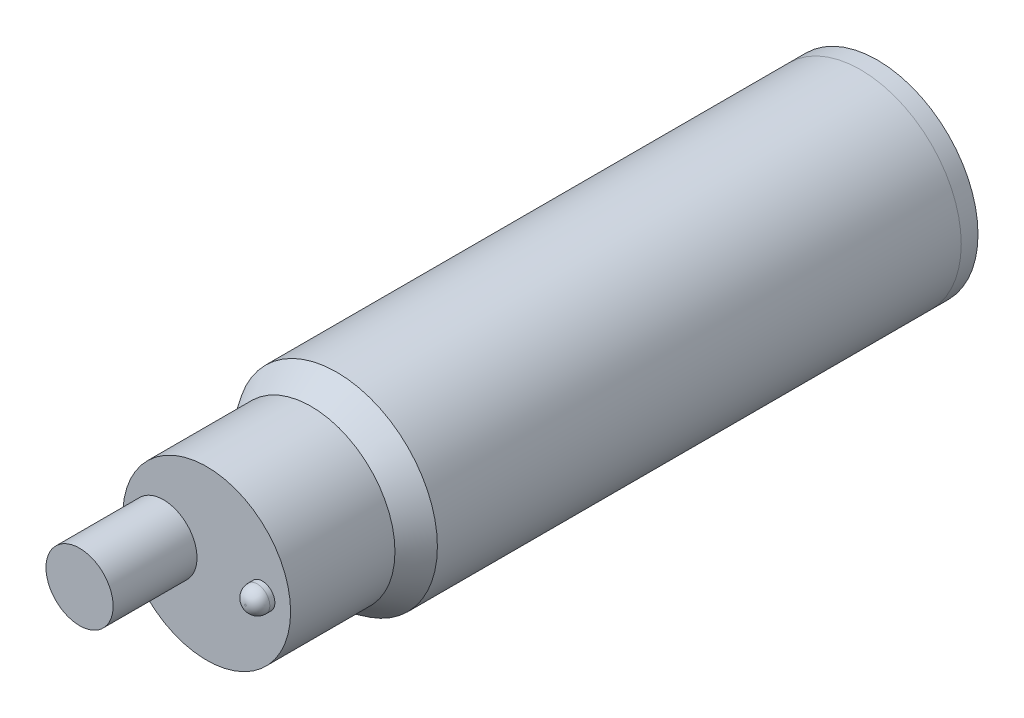
ISO-10303-21;
HEADER;
FILE_DESCRIPTION(('STEP AP214'),'2;1');
FILE_NAME('part.step','',(''),(''),'','','');
FILE_SCHEMA(('AUTOMOTIVE_DESIGN { 1 0 10303 214 1 1 1 1 }'));
ENDSEC;
DATA;
#1=APPLICATION_CONTEXT('core data for automotive mechanical design processes');
#2=APPLICATION_PROTOCOL_DEFINITION('international standard','automotive_design',2000,#1);
#3=PRODUCT_CONTEXT('',#1,'mechanical');
#4=PRODUCT('Part','Part','',(#3));
#5=PRODUCT_RELATED_PRODUCT_CATEGORY('part','',(#4));
#6=PRODUCT_DEFINITION_FORMATION('','',#4);
#7=PRODUCT_DEFINITION_CONTEXT('part definition',#1,'design');
#8=PRODUCT_DEFINITION('design','',#6,#7);
#9=PRODUCT_DEFINITION_SHAPE('','',#8);
#10=(LENGTH_UNIT() NAMED_UNIT(*) SI_UNIT(.MILLI.,.METRE.));
#11=(NAMED_UNIT(*) PLANE_ANGLE_UNIT() SI_UNIT($,.RADIAN.));
#12=(NAMED_UNIT(*) SI_UNIT($,.STERADIAN.) SOLID_ANGLE_UNIT());
#13=UNCERTAINTY_MEASURE_WITH_UNIT(LENGTH_MEASURE(1.E-05),#10,'distance_accuracy_value','');
#14=(GEOMETRIC_REPRESENTATION_CONTEXT(3) GLOBAL_UNCERTAINTY_ASSIGNED_CONTEXT((#13)) GLOBAL_UNIT_ASSIGNED_CONTEXT((#10,
#11,#12)) REPRESENTATION_CONTEXT('',''));
#15=CARTESIAN_POINT('',(0.,0.,0.));
#16=DIRECTION('',(0.,0.,1.));
#17=DIRECTION('',(1.,0.,0.));
#18=AXIS2_PLACEMENT_3D('',#15,#16,#17);
#19=CARTESIAN_POINT('',(6.00000000000001,0.,7.74848911610292));
#20=DIRECTION('',(0.,0.,1.));
#21=DIRECTION('',(1.,0.,0.));
#22=AXIS2_PLACEMENT_3D('',#19,#20,#21);
#23=CYLINDRICAL_SURFACE('',#22,6.00000000000001);
#24=CARTESIAN_POINT('',(6.00000000000001,0.,0.));
#25=DIRECTION('',(0.,0.,1.));
#26=DIRECTION('',(1.,0.,0.));
#27=AXIS2_PLACEMENT_3D('',#24,#25,#26);
#28=CIRCLE('',#27,6.00000000000001);
#29=CARTESIAN_POINT('',(12.,0.,0.));
#30=VERTEX_POINT('',#29);
#31=EDGE_CURVE('E118',#30,#30,#28,.T.);
#32=ORIENTED_EDGE('',*,*,#31,.F.);
#33=EDGE_LOOP('',(#32));
#34=FACE_BOUND('',#33,.T.);
#35=CARTESIAN_POINT('',(5.99696396731597,0.,-31.22));
#36=DIRECTION('',(0.,0.,-1.));
#37=DIRECTION('',(-1.,0.,0.));
#38=AXIS2_PLACEMENT_3D('',#35,#36,#37);
#39=CIRCLE('',#38,6.);
#40=CARTESIAN_POINT('',(-0.00303603268402616,0.,-31.22));
#41=VERTEX_POINT('',#40);
#42=EDGE_CURVE('E55',#41,#41,#39,.T.);
#43=ORIENTED_EDGE('',*,*,#42,.F.);
#44=EDGE_LOOP('',(#43));
#45=FACE_BOUND('',#44,.T.);
#46=ADVANCED_FACE('F35',(#34,#45),#23,.T.);
#47=CARTESIAN_POINT('',(6.00000000000001,0.,0.));
#48=DIRECTION('',(0.,0.,-1.));
#49=DIRECTION('',(-1.,0.,0.));
#50=AXIS2_PLACEMENT_3D('',#47,#48,#49);
#51=CONICAL_SURFACE('',#50,6.00000000000001,0.579350702706522);
#52=CARTESIAN_POINT('',(6.00000000000001,0.,1.52848911610292));
#53=DIRECTION('',(0.,0.,1.));
#54=DIRECTION('',(1.,0.,0.));
#55=AXIS2_PLACEMENT_3D('',#52,#53,#54);
#56=CIRCLE('',#55,5.00000000000001);
#57=CARTESIAN_POINT('',(11.,0.,1.52848911610292));
#58=VERTEX_POINT('',#57);
#59=EDGE_CURVE('E121',#58,#58,#56,.T.);
#60=ORIENTED_EDGE('',*,*,#59,.F.);
#61=EDGE_LOOP('',(#60));
#62=FACE_BOUND('',#61,.T.);
#63=ORIENTED_EDGE('',*,*,#31,.T.);
#64=EDGE_LOOP('',(#63));
#65=FACE_BOUND('',#64,.T.);
#66=ADVANCED_FACE('F107',(#62,#65),#51,.T.);
#67=CARTESIAN_POINT('',(6.00000000000001,0.,7.74848911610292));
#68=DIRECTION('',(0.,0.,1.));
#69=DIRECTION('',(1.,0.,0.));
#70=AXIS2_PLACEMENT_3D('',#67,#68,#69);
#71=CYLINDRICAL_SURFACE('',#70,5.);
#72=CARTESIAN_POINT('',(6.00000000000001,0.,7.74848911610292));
#73=DIRECTION('',(0.,0.,1.));
#74=DIRECTION('',(1.,0.,0.));
#75=AXIS2_PLACEMENT_3D('',#72,#73,#74);
#76=CIRCLE('',#75,5.);
#77=CARTESIAN_POINT('',(11.,0.,7.74848911610292));
#78=VERTEX_POINT('',#77);
#79=EDGE_CURVE('E65',#78,#78,#76,.T.);
#80=ORIENTED_EDGE('',*,*,#79,.F.);
#81=EDGE_LOOP('',(#80));
#82=FACE_BOUND('',#81,.T.);
#83=ORIENTED_EDGE('',*,*,#59,.T.);
#84=EDGE_LOOP('',(#83));
#85=FACE_BOUND('',#84,.T.);
#86=ADVANCED_FACE('F103',(#82,#85),#71,.T.);
#87=CARTESIAN_POINT('',(1.,0.,7.74848911610292));
#88=DIRECTION('',(0.,0.,-1.));
#89=DIRECTION('',(-1.,0.,0.));
#90=AXIS2_PLACEMENT_3D('',#87,#88,#89);
#91=PLANE('',#90);
#92=CARTESIAN_POINT('',(3.4230042005488,0.,7.74848911610292));
#93=DIRECTION('',(0.,0.,-1.));
#94=DIRECTION('',(-1.,0.,0.));
#95=AXIS2_PLACEMENT_3D('',#92,#93,#94);
#96=CIRCLE('',#95,2.);
#97=CARTESIAN_POINT('',(1.42300420054879,0.,7.74848911610292));
#98=VERTEX_POINT('',#97);
#99=EDGE_CURVE('E10',#98,#98,#96,.F.);
#100=ORIENTED_EDGE('',*,*,#99,.F.);
#101=EDGE_LOOP('',(#100));
#102=FACE_BOUND('',#101,.T.);
#103=CARTESIAN_POINT('',(9.31104914838581,0.,7.74848911610292));
#104=DIRECTION('',(0.,0.,-1.));
#105=DIRECTION('',(-1.,0.,0.));
#106=AXIS2_PLACEMENT_3D('',#103,#104,#105);
#107=CIRCLE('',#106,0.75);
#108=CARTESIAN_POINT('',(8.56104914838581,0.,7.74848911610292));
#109=VERTEX_POINT('',#108);
#110=EDGE_CURVE('E120',#109,#109,#107,.F.);
#111=ORIENTED_EDGE('',*,*,#110,.F.);
#112=EDGE_LOOP('',(#111));
#113=FACE_BOUND('',#112,.T.);
#114=ORIENTED_EDGE('',*,*,#79,.T.);
#115=EDGE_LOOP('',(#114));
#116=FACE_BOUND('',#115,.T.);
#117=ADVANCED_FACE('F99',(#102,#113,#116),#91,.F.);
#118=CARTESIAN_POINT('',(9.31104914838581,0.,8.74848911610292));
#119=DIRECTION('',(0.,0.,-1.));
#120=DIRECTION('',(-1.,0.,0.));
#121=AXIS2_PLACEMENT_3D('',#118,#119,#120);
#122=CYLINDRICAL_SURFACE('',#121,0.75);
#123=CARTESIAN_POINT('',(9.31104914838581,0.,8.04848911610292));
#124=DIRECTION('',(0.,0.,1.));
#125=DIRECTION('',(1.,0.,0.));
#126=AXIS2_PLACEMENT_3D('',#123,#124,#125);
#127=CIRCLE('',#126,0.75);
#128=CARTESIAN_POINT('',(10.0610491483858,0.,8.04848911610292));
#129=VERTEX_POINT('',#128);
#130=EDGE_CURVE('E44',#129,#129,#127,.F.);
#131=ORIENTED_EDGE('',*,*,#130,.T.);
#132=EDGE_LOOP('',(#131));
#133=FACE_BOUND('',#132,.T.);
#134=ORIENTED_EDGE('',*,*,#110,.T.);
#135=EDGE_LOOP('',(#134));
#136=FACE_BOUND('',#135,.T.);
#137=ADVANCED_FACE('F95',(#133,#136),#122,.T.);
#138=CARTESIAN_POINT('',(9.31104914838581,0.,8.74848911610292));
#139=DIRECTION('',(0.,0.,1.));
#140=DIRECTION('',(1.,0.,0.));
#141=AXIS2_PLACEMENT_3D('',#138,#139,#140);
#142=PLANE('',#141);
#143=CARTESIAN_POINT('',(9.31104914838581,0.,8.74848911610292));
#144=DIRECTION('',(0.,0.,1.));
#145=DIRECTION('',(1.,0.,0.));
#146=AXIS2_PLACEMENT_3D('',#143,#144,#145);
#147=CIRCLE('',#146,0.0500000000000003);
#148=CARTESIAN_POINT('',(9.3610491483858,0.,8.74848911610292));
#149=VERTEX_POINT('',#148);
#150=EDGE_CURVE('E49',#149,#149,#147,.T.);
#151=ORIENTED_EDGE('',*,*,#150,.T.);
#152=EDGE_LOOP('',(#151));
#153=FACE_BOUND('',#152,.T.);
#154=ADVANCED_FACE('F92',(#153),#142,.T.);
#155=CARTESIAN_POINT('',(9.31104914838581,0.,8.04848911610292));
#156=DIRECTION('',(0.,0.,1.));
#157=DIRECTION('',(1.,0.,0.));
#158=AXIS2_PLACEMENT_3D('',#155,#156,#157);
#159=DEGENERATE_TOROIDAL_SURFACE('',#158,0.0500000000000003,0.7,.T.);
#160=ORIENTED_EDGE('',*,*,#130,.F.);
#161=EDGE_LOOP('',(#160));
#162=FACE_BOUND('',#161,.T.);
#163=ORIENTED_EDGE('',*,*,#150,.F.);
#164=EDGE_LOOP('',(#163));
#165=FACE_BOUND('',#164,.T.);
#166=ADVANCED_FACE('F37',(#162,#165),#159,.T.);
#167=CARTESIAN_POINT('',(3.4230042005488,0.,12.7484891161029));
#168=DIRECTION('',(0.,0.,-1.));
#169=DIRECTION('',(-1.,0.,0.));
#170=AXIS2_PLACEMENT_3D('',#167,#168,#169);
#171=CYLINDRICAL_SURFACE('',#170,2.);
#172=CARTESIAN_POINT('',(3.4230042005488,0.,12.7484891161029));
#173=DIRECTION('',(0.,0.,1.));
#174=DIRECTION('',(1.,0.,0.));
#175=AXIS2_PLACEMENT_3D('',#172,#173,#174);
#176=CIRCLE('',#175,2.);
#177=CARTESIAN_POINT('',(5.4230042005488,0.,12.7484891161029));
#178=VERTEX_POINT('',#177);
#179=EDGE_CURVE('E60',#178,#178,#176,.T.);
#180=ORIENTED_EDGE('',*,*,#179,.F.);
#181=EDGE_LOOP('',(#180));
#182=FACE_BOUND('',#181,.T.);
#183=ORIENTED_EDGE('',*,*,#99,.T.);
#184=EDGE_LOOP('',(#183));
#185=FACE_BOUND('',#184,.T.);
#186=ADVANCED_FACE('F87',(#182,#185),#171,.T.);
#187=CARTESIAN_POINT('',(3.4230042005488,0.,12.7484891161029));
#188=DIRECTION('',(0.,0.,1.));
#189=DIRECTION('',(1.,0.,0.));
#190=AXIS2_PLACEMENT_3D('',#187,#188,#189);
#191=PLANE('',#190);
#192=ORIENTED_EDGE('',*,*,#179,.T.);
#193=EDGE_LOOP('',(#192));
#194=FACE_BOUND('',#193,.T.);
#195=ADVANCED_FACE('F83',(#194),#191,.T.);
#196=CARTESIAN_POINT('',(5.99696396731597,0.,-32.22));
#197=DIRECTION('',(0.,0.,1.));
#198=DIRECTION('',(1.,0.,0.));
#199=AXIS2_PLACEMENT_3D('',#196,#197,#198);
#200=CYLINDRICAL_SURFACE('',#199,6.);
#201=CARTESIAN_POINT('',(5.99696396731597,0.,-32.22));
#202=DIRECTION('',(0.,0.,-1.));
#203=DIRECTION('',(-1.,0.,0.));
#204=AXIS2_PLACEMENT_3D('',#201,#202,#203);
#205=CIRCLE('',#204,6.);
#206=CARTESIAN_POINT('',(-0.00303603268402616,0.,-32.22));
#207=VERTEX_POINT('',#206);
#208=EDGE_CURVE('E58',#207,#207,#205,.T.);
#209=ORIENTED_EDGE('',*,*,#208,.F.);
#210=EDGE_LOOP('',(#209));
#211=FACE_BOUND('',#210,.T.);
#212=ORIENTED_EDGE('',*,*,#42,.T.);
#213=EDGE_LOOP('',(#212));
#214=FACE_BOUND('',#213,.T.);
#215=ADVANCED_FACE('F72',(#211,#214),#200,.T.);
#216=CARTESIAN_POINT('',(5.99696396731597,0.,-32.22));
#217=DIRECTION('',(0.,0.,-1.));
#218=DIRECTION('',(-1.,0.,0.));
#219=AXIS2_PLACEMENT_3D('',#216,#217,#218);
#220=PLANE('',#219);
#221=ORIENTED_EDGE('',*,*,#208,.T.);
#222=EDGE_LOOP('',(#221));
#223=FACE_BOUND('',#222,.T.);
#224=ADVANCED_FACE('F82',(#223),#220,.T.);
#225=CLOSED_SHELL('',(#46,#66,#86,#117,#137,#154,#166,#186,#195,#215,#224));
#226=MANIFOLD_SOLID_BREP('B2',#225);
#227=ADVANCED_BREP_SHAPE_REPRESENTATION('',(#18,#226),#14);
#228=SHAPE_DEFINITION_REPRESENTATION(#9,#227);
ENDSEC;
END-ISO-10303-21;
